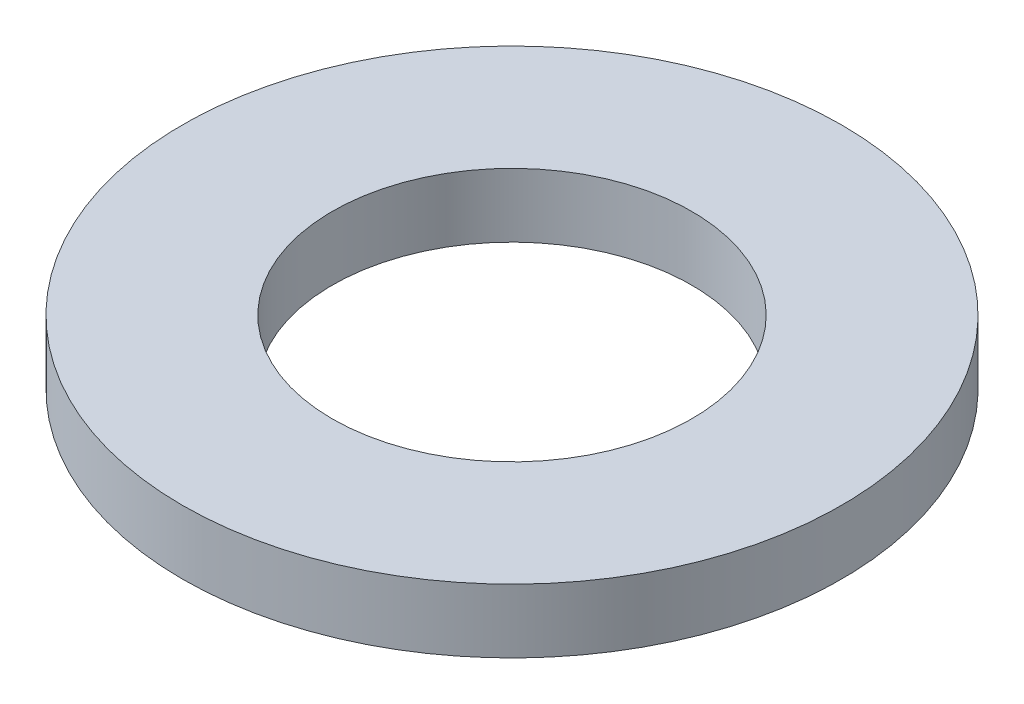
ISO-10303-21;
HEADER;
FILE_DESCRIPTION(('STEP AP214'),'2;1');
FILE_NAME('part.step','',(''),(''),'','','');
FILE_SCHEMA(('AUTOMOTIVE_DESIGN { 1 0 10303 214 1 1 1 1 }'));
ENDSEC;
DATA;
#1=APPLICATION_CONTEXT('core data for automotive mechanical design processes');
#2=APPLICATION_PROTOCOL_DEFINITION('international standard','automotive_design',2000,#1);
#3=PRODUCT_CONTEXT('',#1,'mechanical');
#4=PRODUCT('Part','Part','',(#3));
#5=PRODUCT_RELATED_PRODUCT_CATEGORY('part','',(#4));
#6=PRODUCT_DEFINITION_FORMATION('','',#4);
#7=PRODUCT_DEFINITION_CONTEXT('part definition',#1,'design');
#8=PRODUCT_DEFINITION('design','',#6,#7);
#9=PRODUCT_DEFINITION_SHAPE('','',#8);
#10=(LENGTH_UNIT() NAMED_UNIT(*) SI_UNIT(.MILLI.,.METRE.));
#11=(NAMED_UNIT(*) PLANE_ANGLE_UNIT() SI_UNIT($,.RADIAN.));
#12=(NAMED_UNIT(*) SI_UNIT($,.STERADIAN.) SOLID_ANGLE_UNIT());
#13=UNCERTAINTY_MEASURE_WITH_UNIT(LENGTH_MEASURE(1.E-05),#10,'distance_accuracy_value','');
#14=(GEOMETRIC_REPRESENTATION_CONTEXT(3) GLOBAL_UNCERTAINTY_ASSIGNED_CONTEXT((#13)) GLOBAL_UNIT_ASSIGNED_CONTEXT((#10,
#11,#12)) REPRESENTATION_CONTEXT('',''));
#15=CARTESIAN_POINT('',(0.,0.,0.));
#16=DIRECTION('',(0.,0.,1.));
#17=DIRECTION('',(1.,0.,0.));
#18=AXIS2_PLACEMENT_3D('',#15,#16,#17);
#19=CARTESIAN_POINT('',(0.,16.,0.));
#20=DIRECTION('',(0.,-1.,0.));
#21=DIRECTION('',(0.,0.,-1.));
#22=AXIS2_PLACEMENT_3D('',#19,#20,#21);
#23=CYLINDRICAL_SURFACE('',#22,82.5);
#24=CARTESIAN_POINT('',(0.,16.,0.));
#25=DIRECTION('',(0.,1.,0.));
#26=DIRECTION('',(0.,0.,1.));
#27=AXIS2_PLACEMENT_3D('',#24,#25,#26);
#28=CIRCLE('',#27,82.5);
#29=CARTESIAN_POINT('',(0.,16.,82.5));
#30=VERTEX_POINT('',#29);
#31=EDGE_CURVE('E10',#30,#30,#28,.T.);
#32=ORIENTED_EDGE('',*,*,#31,.F.);
#33=EDGE_LOOP('',(#32));
#34=FACE_BOUND('',#33,.T.);
#35=CARTESIAN_POINT('',(0.,0.,0.));
#36=DIRECTION('',(0.,1.,0.));
#37=DIRECTION('',(0.,0.,1.));
#38=AXIS2_PLACEMENT_3D('',#35,#36,#37);
#39=CIRCLE('',#38,82.5);
#40=CARTESIAN_POINT('',(0.,0.,82.5));
#41=VERTEX_POINT('',#40);
#42=EDGE_CURVE('E37',#41,#41,#39,.T.);
#43=ORIENTED_EDGE('',*,*,#42,.T.);
#44=EDGE_LOOP('',(#43));
#45=FACE_BOUND('',#44,.T.);
#46=ADVANCED_FACE('F40',(#34,#45),#23,.T.);
#47=CARTESIAN_POINT('',(0.,16.,0.));
#48=DIRECTION('',(0.,1.,0.));
#49=DIRECTION('',(0.,0.,1.));
#50=AXIS2_PLACEMENT_3D('',#47,#48,#49);
#51=PLANE('',#50);
#52=CARTESIAN_POINT('',(0.,16.,0.));
#53=DIRECTION('',(0.,1.,0.));
#54=DIRECTION('',(0.,0.,1.));
#55=AXIS2_PLACEMENT_3D('',#52,#53,#54);
#56=CIRCLE('',#55,45.);
#57=CARTESIAN_POINT('',(0.,16.,45.));
#58=VERTEX_POINT('',#57);
#59=EDGE_CURVE('E50',#58,#58,#56,.T.);
#60=ORIENTED_EDGE('',*,*,#59,.F.);
#61=EDGE_LOOP('',(#60));
#62=FACE_BOUND('',#61,.T.);
#63=ORIENTED_EDGE('',*,*,#31,.T.);
#64=EDGE_LOOP('',(#63));
#65=FACE_BOUND('',#64,.T.);
#66=ADVANCED_FACE('F59',(#62,#65),#51,.T.);
#67=CARTESIAN_POINT('',(0.,0.,0.));
#68=DIRECTION('',(0.,1.,0.));
#69=DIRECTION('',(0.,0.,1.));
#70=AXIS2_PLACEMENT_3D('',#67,#68,#69);
#71=PLANE('',#70);
#72=CARTESIAN_POINT('',(0.,0.,0.));
#73=DIRECTION('',(0.,1.,0.));
#74=DIRECTION('',(0.,0.,1.));
#75=AXIS2_PLACEMENT_3D('',#72,#73,#74);
#76=CIRCLE('',#75,45.);
#77=CARTESIAN_POINT('',(0.,0.,45.));
#78=VERTEX_POINT('',#77);
#79=EDGE_CURVE('E47',#78,#78,#76,.T.);
#80=ORIENTED_EDGE('',*,*,#79,.T.);
#81=EDGE_LOOP('',(#80));
#82=FACE_BOUND('',#81,.T.);
#83=ORIENTED_EDGE('',*,*,#42,.F.);
#84=EDGE_LOOP('',(#83));
#85=FACE_BOUND('',#84,.T.);
#86=ADVANCED_FACE('F58',(#82,#85),#71,.F.);
#87=CARTESIAN_POINT('',(0.,16.,0.));
#88=DIRECTION('',(0.,-1.,0.));
#89=DIRECTION('',(0.,0.,-1.));
#90=AXIS2_PLACEMENT_3D('',#87,#88,#89);
#91=CYLINDRICAL_SURFACE('',#90,45.);
#92=ORIENTED_EDGE('',*,*,#59,.T.);
#93=EDGE_LOOP('',(#92));
#94=FACE_BOUND('',#93,.T.);
#95=ORIENTED_EDGE('',*,*,#79,.F.);
#96=EDGE_LOOP('',(#95));
#97=FACE_BOUND('',#96,.T.);
#98=ADVANCED_FACE('F54',(#94,#97),#91,.F.);
#99=CLOSED_SHELL('',(#46,#66,#86,#98));
#100=MANIFOLD_SOLID_BREP('B2',#99);
#101=ADVANCED_BREP_SHAPE_REPRESENTATION('',(#18,#100),#14);
#102=SHAPE_DEFINITION_REPRESENTATION(#9,#101);
ENDSEC;
END-ISO-10303-21;
